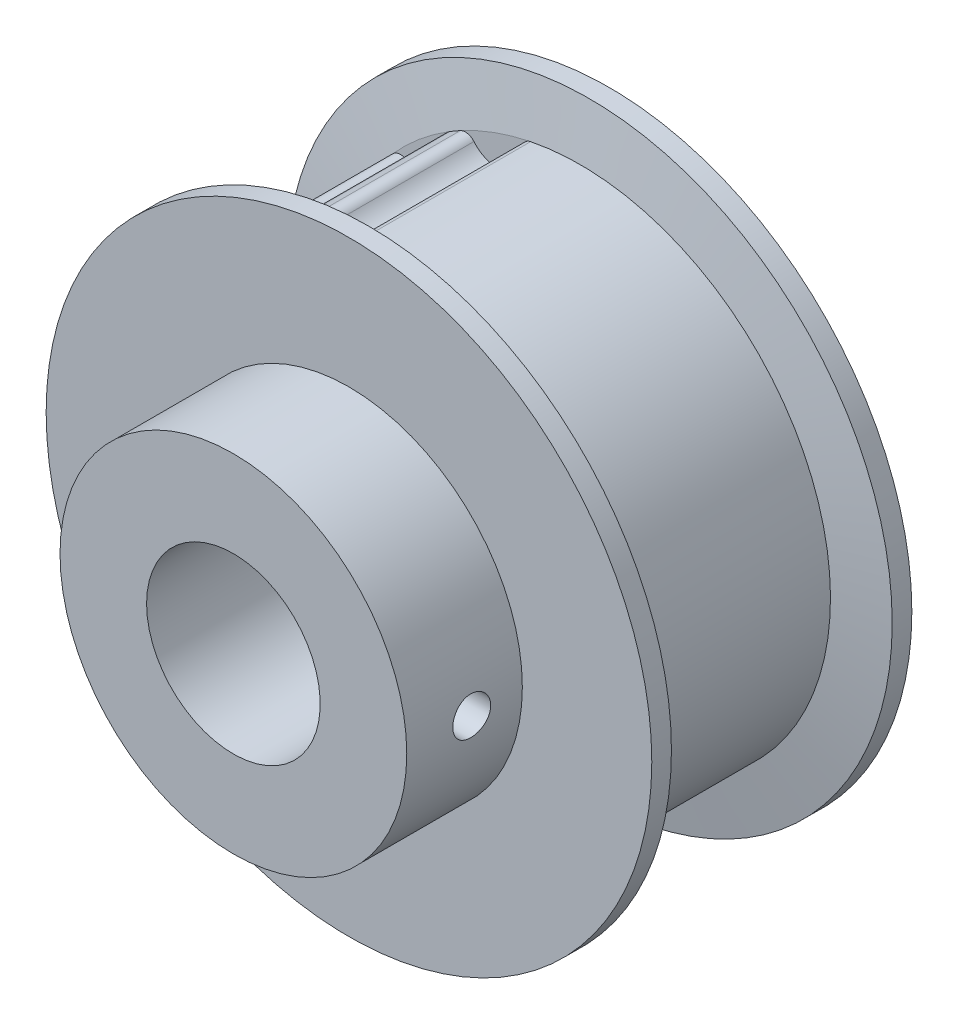
ISO-10303-21;
HEADER;
FILE_DESCRIPTION(('STEP AP214'),'2;1');
FILE_NAME('part.step','',(''),(''),'','','');
FILE_SCHEMA(('AUTOMOTIVE_DESIGN { 1 0 10303 214 1 1 1 1 }'));
ENDSEC;
DATA;
#1=APPLICATION_CONTEXT('core data for automotive mechanical design processes');
#2=APPLICATION_PROTOCOL_DEFINITION('international standard','automotive_design',2000,#1);
#3=PRODUCT_CONTEXT('',#1,'mechanical');
#4=PRODUCT('Part','Part','',(#3));
#5=PRODUCT_RELATED_PRODUCT_CATEGORY('part','',(#4));
#6=PRODUCT_DEFINITION_FORMATION('','',#4);
#7=PRODUCT_DEFINITION_CONTEXT('part definition',#1,'design');
#8=PRODUCT_DEFINITION('design','',#6,#7);
#9=PRODUCT_DEFINITION_SHAPE('','',#8);
#10=(LENGTH_UNIT() NAMED_UNIT(*) SI_UNIT(.MILLI.,.METRE.));
#11=(NAMED_UNIT(*) PLANE_ANGLE_UNIT() SI_UNIT($,.RADIAN.));
#12=(NAMED_UNIT(*) SI_UNIT($,.STERADIAN.) SOLID_ANGLE_UNIT());
#13=UNCERTAINTY_MEASURE_WITH_UNIT(LENGTH_MEASURE(1.E-05),#10,'distance_accuracy_value','');
#14=(GEOMETRIC_REPRESENTATION_CONTEXT(3) GLOBAL_UNCERTAINTY_ASSIGNED_CONTEXT((#13)) GLOBAL_UNIT_ASSIGNED_CONTEXT((#10,
#11,#12)) REPRESENTATION_CONTEXT('',''));
#15=CARTESIAN_POINT('',(0.,0.,0.));
#16=DIRECTION('',(0.,0.,1.));
#17=DIRECTION('',(1.,0.,0.));
#18=AXIS2_PLACEMENT_3D('',#15,#16,#17);
#19=CARTESIAN_POINT('',(0.,0.,13.49375));
#20=DIRECTION('',(0.,0.,1.));
#21=DIRECTION('',(1.,0.,0.));
#22=AXIS2_PLACEMENT_3D('',#19,#20,#21);
#23=PLANE('',#22);
#24=CARTESIAN_POINT('',(0.,0.,13.49375));
#25=DIRECTION('',(0.,0.,-1.));
#26=DIRECTION('',(-1.,0.,0.));
#27=AXIS2_PLACEMENT_3D('',#24,#25,#26);
#28=CIRCLE('',#27,4.76885);
#29=CARTESIAN_POINT('',(-4.76885,0.,13.49375));
#30=VERTEX_POINT('',#29);
#31=EDGE_CURVE('E430',#30,#30,#28,.T.);
#32=ORIENTED_EDGE('',*,*,#31,.T.);
#33=EDGE_LOOP('',(#32));
#34=FACE_BOUND('',#33,.T.);
#35=CARTESIAN_POINT('',(0.,0.,13.49375));
#36=DIRECTION('',(0.,0.,1.));
#37=DIRECTION('',(1.,0.,0.));
#38=AXIS2_PLACEMENT_3D('',#35,#36,#37);
#39=CIRCLE('',#38,9.525);
#40=CARTESIAN_POINT('',(9.525,0.,13.49375));
#41=VERTEX_POINT('',#40);
#42=EDGE_CURVE('E257',#41,#41,#39,.F.);
#43=ORIENTED_EDGE('',*,*,#42,.F.);
#44=EDGE_LOOP('',(#43));
#45=FACE_BOUND('',#44,.T.);
#46=ADVANCED_FACE('F16',(#34,#45),#23,.T.);
#47=CARTESIAN_POINT('',(0.,0.,9.921875));
#48=DIRECTION('',(-1.,0.,0.));
#49=DIRECTION('',(0.,0.,1.));
#50=AXIS2_PLACEMENT_3D('',#47,#48,#49);
#51=CYLINDRICAL_SURFACE('',#50,1.0414);
#52=CARTESIAN_POINT('',(4.76885,0.,8.880475));
#53=CARTESIAN_POINT('',(4.76884852330847,-0.0576985977662349,8.88047783334648));
#54=CARTESIAN_POINT('',(4.76779113617703,-0.115467533123418,8.88529102624313));
#55=CARTESIAN_POINT('',(4.7636714430234,-0.229412794410988,8.90441091337079));
#56=CARTESIAN_POINT('',(4.76060523450025,-0.285585797876013,8.91873608708849));
#57=CARTESIAN_POINT('',(4.7528096560498,-0.394604188509253,8.95641099825753));
#58=CARTESIAN_POINT('',(4.74808281450999,-0.447454491220938,8.97974702161308));
#59=CARTESIAN_POINT('',(4.73747744549021,-0.548471129240607,9.03474411265659));
#60=CARTESIAN_POINT('',(4.73159927002114,-0.596638889479045,9.06640263681796));
#61=CARTESIAN_POINT('',(4.71922840595486,-0.687720111083311,9.13768932718942));
#62=CARTESIAN_POINT('',(4.71272806419331,-0.730547577913806,9.17742605747561));
#63=CARTESIAN_POINT('',(4.69989922363985,-0.808987687584566,9.26350998249827));
#64=CARTESIAN_POINT('',(4.69357074951007,-0.844599299674293,9.30985812003383));
#65=CARTESIAN_POINT('',(4.68172784625236,-0.907969596174088,9.40847706791252));
#66=CARTESIAN_POINT('',(4.6762231292802,-0.935637662620655,9.46080737794415));
#67=CARTESIAN_POINT('',(4.66675985238805,-0.9817538722819,9.56951435714228));
#68=CARTESIAN_POINT('',(4.66280109547798,-1.00020319025624,9.62589050969306));
#69=CARTESIAN_POINT('',(4.6569552161561,-1.02707665450748,9.74016386018618));
#70=CARTESIAN_POINT('',(4.65503691801135,-1.03565183848001,9.79802390989361));
#71=CARTESIAN_POINT('',(4.65339551770343,-1.04300323002775,9.91439084590502));
#72=CARTESIAN_POINT('',(4.6536721497645,-1.04178062397998,9.97289765303889));
#73=CARTESIAN_POINT('',(4.65636112309822,-1.02969272438743,10.0877742118658));
#74=CARTESIAN_POINT('',(4.65873459304935,-1.01900292544007,10.1441634777581));
#75=CARTESIAN_POINT('',(4.66528838620344,-0.988561962019837,10.2543288612698));
#76=CARTESIAN_POINT('',(4.66946882358612,-0.968810224931051,10.3081048135186));
#77=CARTESIAN_POINT('',(4.67920400334399,-0.920644101942968,10.4120117764203));
#78=CARTESIAN_POINT('',(4.68476943248521,-0.892161935123675,10.4621103240891));
#79=CARTESIAN_POINT('',(4.69664043972502,-0.827393269707686,10.556878263446));
#80=CARTESIAN_POINT('',(4.70294606567334,-0.791106266443958,10.6015473037654));
#81=CARTESIAN_POINT('',(4.71575299818434,-0.710835752314663,10.6851952486317));
#82=CARTESIAN_POINT('',(4.722255606314,-0.666704297415194,10.7240321048294));
#83=CARTESIAN_POINT('',(4.73460399425114,-0.572459848968609,10.793793179643));
#84=CARTESIAN_POINT('',(4.74044948754397,-0.522344265715604,10.8247139541441));
#85=CARTESIAN_POINT('',(4.75084460104688,-0.417367303882323,10.8777985495764));
#86=CARTESIAN_POINT('',(4.75539042446044,-0.36249261880154,10.8999367851618));
#87=CARTESIAN_POINT('',(4.762638802077,-0.249749978800202,10.934595695224));
#88=CARTESIAN_POINT('',(4.76534521412753,-0.191888564166974,10.9471365056514));
#89=CARTESIAN_POINT('',(4.76760264695253,-0.111311683540151,10.9575503142808));
#90=CARTESIAN_POINT('',(4.76806932141351,-0.0891092303293494,10.959695152105));
#91=CARTESIAN_POINT('',(4.76869328368904,-0.0446080233390702,10.9625580439646));
#92=CARTESIAN_POINT('',(4.76885057096551,-0.0223092693921756,10.9632760955186));
#93=CARTESIAN_POINT('',(4.76884852330847,0.0576985977662349,10.9632721666535));
#94=CARTESIAN_POINT('',(4.76779113617703,0.115467533123418,10.9584589737569));
#95=CARTESIAN_POINT('',(4.7636714430234,0.229412794410988,10.9393390866292));
#96=CARTESIAN_POINT('',(4.76060523450025,0.285585797876013,10.9250139129115));
#97=CARTESIAN_POINT('',(4.7528096560498,0.394604188509254,10.8873390017425));
#98=CARTESIAN_POINT('',(4.74808281450998,0.44745449122094,10.8640029783869));
#99=CARTESIAN_POINT('',(4.73747744549021,0.548471129240609,10.8090058873434));
#100=CARTESIAN_POINT('',(4.73159927002114,0.596638889479046,10.777347363182));
#101=CARTESIAN_POINT('',(4.71922840595486,0.687720111083311,10.7060606728106));
#102=CARTESIAN_POINT('',(4.71272806419331,0.730547577913807,10.6663239425244));
#103=CARTESIAN_POINT('',(4.69989922363985,0.808987687584567,10.5802400175017));
#104=CARTESIAN_POINT('',(4.69357074951007,0.844599299674294,10.5338918799662));
#105=CARTESIAN_POINT('',(4.68172784625236,0.907969596174089,10.4352729320875));
#106=CARTESIAN_POINT('',(4.67622312928019,0.935637662620656,10.3829426220558));
#107=CARTESIAN_POINT('',(4.66675985238805,0.981753872281901,10.2742356428577));
#108=CARTESIAN_POINT('',(4.66280109547798,1.00020319025624,10.2178594903069));
#109=CARTESIAN_POINT('',(4.6569552161561,1.02707665450748,10.1035861398138));
#110=CARTESIAN_POINT('',(4.65503691801135,1.03565183848001,10.0457260901064));
#111=CARTESIAN_POINT('',(4.65339551770343,1.04300323002775,9.92935915409498));
#112=CARTESIAN_POINT('',(4.6536721497645,1.04178062397998,9.87085234696111));
#113=CARTESIAN_POINT('',(4.65636112309822,1.02969272438743,9.75597578813423));
#114=CARTESIAN_POINT('',(4.65873459304935,1.01900292544007,9.69958652224186));
#115=CARTESIAN_POINT('',(4.66528838620344,0.988561962019837,9.5894211387302));
#116=CARTESIAN_POINT('',(4.66946882358612,0.968810224931051,9.53564518648141));
#117=CARTESIAN_POINT('',(4.67920400334399,0.920644101942968,9.43173822357966));
#118=CARTESIAN_POINT('',(4.68476943248521,0.892161935123675,9.38163967591089));
#119=CARTESIAN_POINT('',(4.69664043972502,0.827393269707686,9.28687173655398));
#120=CARTESIAN_POINT('',(4.70294606567334,0.791106266443958,9.24220269623464));
#121=CARTESIAN_POINT('',(4.71575299818434,0.710835752314663,9.15855475136825));
#122=CARTESIAN_POINT('',(4.722255606314,0.666704297415194,9.11971789517061));
#123=CARTESIAN_POINT('',(4.73460399425114,0.572459848968609,9.04995682035704));
#124=CARTESIAN_POINT('',(4.74044948754397,0.522344265715604,9.01903604585591));
#125=CARTESIAN_POINT('',(4.75084460104688,0.417367303882323,8.96595145042363));
#126=CARTESIAN_POINT('',(4.75539042446044,0.36249261880154,8.94381321483817));
#127=CARTESIAN_POINT('',(4.762638802077,0.249749978800202,8.90915430477605));
#128=CARTESIAN_POINT('',(4.76534521412753,0.191888564166974,8.89661349434864));
#129=CARTESIAN_POINT('',(4.76760264695253,0.111311683540151,8.88619968571916));
#130=CARTESIAN_POINT('',(4.76806932141351,0.0891092303293492,8.88405484789503));
#131=CARTESIAN_POINT('',(4.76869328368904,0.0446080233390703,8.8811919560354));
#132=CARTESIAN_POINT('',(4.76885057096551,0.0223092693921757,8.88047390448135));
#133=CARTESIAN_POINT('',(4.76885,0.,8.880475));
#134=B_SPLINE_CURVE_WITH_KNOTS('',3,(#52,#53,#54,#55,#56,#57,#58,#59,#60,#61,#62,#63,#64,#65,
#66,#67,#68,#69,#70,#71,#72,#73,#74,#75,#76,#77,#78,#79,#80,#81,#82,#83,#84,#85,#86,#87,#88,#89,
#90,#91,#92,#93,#94,#95,#96,#97,#98,#99,#100,#101,#102,#103,#104,#105,#106,#107,#108,#109,#110,
#111,#112,#113,#114,#115,#116,#117,#118,#119,#120,#121,#122,#123,#124,#125,#126,#127,#128,#129,
#130,#131,#132,#133),.UNSPECIFIED.,.T.,.F.,(4,2,2,2,2,2,2,2,2,2,2,2,2,2,2,2,2,2,2,2,2,2,2,2,2,2,
2,2,2,2,2,2,2,2,2,2,2,2,2,2,4),(0.,0.173010416635859,0.346357938104146,0.519442665986896,
0.692474557008029,0.868007080836766,1.04356466100289,1.22105188557719,1.39851648690266,
1.57322888537201,1.74792012890324,1.91943933661092,2.09096938395979,2.2638664077814,
2.43677461462704,2.61337902633212,2.79006014468995,2.967252256972,3.14407158301989,
3.2109662638097,3.27786106094185,3.45087147757771,3.624218999046,3.79730372692875,
3.97033561794988,4.14586814177862,4.32142572194474,4.49891294651904,4.67637754784452,
4.85108994631387,5.0257811898451,5.19730039755278,5.36883044490165,5.54172746872326,
5.71463567556889,5.89124008727397,6.06792120563181,6.24511331791386,6.42193264396174,
6.48882732475156,6.55572212188371),.UNSPECIFIED.);
#135=CARTESIAN_POINT('',(4.76885,0.,8.880475));
#136=VERTEX_POINT('',#135);
#137=EDGE_CURVE('E19',#136,#136,#134,.T.);
#138=ORIENTED_EDGE('',*,*,#137,.T.);
#139=EDGE_LOOP('',(#138));
#140=FACE_BOUND('',#139,.T.);
#141=CARTESIAN_POINT('',(9.525,0.,10.963275));
#142=CARTESIAN_POINT('',(9.52499884639291,0.0582735292877629,10.9632703283392));
#143=CARTESIAN_POINT('',(9.52445933936864,0.116595322619603,10.9583657462391));
#144=CARTESIAN_POINT('',(9.52235688032514,0.231674615958853,10.9388603132041));
#145=CARTESIAN_POINT('',(9.52079178568485,0.288428581251985,10.9242391618529));
#146=CARTESIAN_POINT('',(9.51681512818299,0.398610716462479,10.8857338292278));
#147=CARTESIAN_POINT('',(9.51440442439465,0.452042197152047,10.861859046351));
#148=CARTESIAN_POINT('',(9.50900607943094,0.554115245606015,10.8055419729624));
#149=CARTESIAN_POINT('',(9.50601868600653,0.602758856780225,10.773103359356));
#150=CARTESIAN_POINT('',(9.49978626741521,0.694113585429947,10.7004250789522));
#151=CARTESIAN_POINT('',(9.4965402846776,0.736800873572002,10.6601555379607));
#152=CARTESIAN_POINT('',(9.49016425329055,0.814827559109186,10.5730206194688));
#153=CARTESIAN_POINT('',(9.48703421590986,0.850166243823228,10.5261546029686));
#154=CARTESIAN_POINT('',(9.4812353245689,0.912573290224957,10.4270119986482));
#155=CARTESIAN_POINT('',(9.47856765765727,0.93962049790762,10.3747220196864));
#156=CARTESIAN_POINT('',(9.47400738878788,0.984541426813792,10.2663088138172));
#157=CARTESIAN_POINT('',(9.4721147573862,1.00241549653528,10.2101857326255));
#158=CARTESIAN_POINT('',(9.46932745871274,1.0284135860093,10.0959376370461));
#159=CARTESIAN_POINT('',(9.46842882035886,1.03657641291381,10.037821552076));
#160=CARTESIAN_POINT('',(9.46771900124972,1.04304030312059,9.92103776293238));
#161=CARTESIAN_POINT('',(9.46790778857706,1.04134165587035,9.86237007499956));
#162=CARTESIAN_POINT('',(9.46934785721121,1.02816278176514,9.74641761833394));
#163=CARTESIAN_POINT('',(9.47059451212957,1.01672514582905,9.68912794324888));
#164=CARTESIAN_POINT('',(9.47400264649458,0.984459128926173,9.57728563967636));
#165=CARTESIAN_POINT('',(9.47616414869426,0.96363051439681,9.52273307930106));
#166=CARTESIAN_POINT('',(9.48116381762611,0.913126360227213,9.41777858563978));
#167=CARTESIAN_POINT('',(9.48400343954042,0.883431760228055,9.36738589636309));
#168=CARTESIAN_POINT('',(9.49003790511303,0.816054943773715,9.27228736899015));
#169=CARTESIAN_POINT('',(9.49323273206631,0.778373102876901,9.22758126367003));
#170=CARTESIAN_POINT('',(9.49963783803421,0.695861448725414,9.14488072390628));
#171=CARTESIAN_POINT('',(9.50284811298077,0.650996249503975,9.10692158792468));
#172=CARTESIAN_POINT('',(9.50890863475555,0.555488462772246,9.03905031141228));
#173=CARTESIAN_POINT('',(9.51175871514799,0.504843224888206,9.00914188372794));
#174=CARTESIAN_POINT('',(9.51677936130814,0.399169316534392,8.95822404776294));
#175=CARTESIAN_POINT('',(9.51894921472695,0.344136126026761,8.93722396042425));
#176=CARTESIAN_POINT('',(9.52235521284579,0.231386038017177,8.90481923855413));
#177=CARTESIAN_POINT('',(9.52359333607432,0.173675105144426,8.89339426537073));
#178=CARTESIAN_POINT('',(9.52476564503519,0.0771251617079257,8.88261573509716));
#179=CARTESIAN_POINT('',(9.52500076361025,0.0385731544175606,8.88047190767498));
#180=CARTESIAN_POINT('',(9.52499884639291,-0.0582735292877636,8.88047967166077));
#181=CARTESIAN_POINT('',(9.52445933936864,-0.116595322619604,8.88538425376087));
#182=CARTESIAN_POINT('',(9.52235688032514,-0.231674615958854,8.90488968679589));
#183=CARTESIAN_POINT('',(9.52079178568485,-0.288428581251986,8.91951083814708));
#184=CARTESIAN_POINT('',(9.51681512818299,-0.39861071646248,8.95801617077216));
#185=CARTESIAN_POINT('',(9.51440442439465,-0.452042197152048,8.98189095364897));
#186=CARTESIAN_POINT('',(9.50900607943094,-0.554115245606016,9.03820802703758));
#187=CARTESIAN_POINT('',(9.50601868600653,-0.602758856780226,9.07064664064402));
#188=CARTESIAN_POINT('',(9.49978626741521,-0.694113585429948,9.14332492104782));
#189=CARTESIAN_POINT('',(9.4965402846776,-0.736800873572002,9.18359446203933));
#190=CARTESIAN_POINT('',(9.49016425329055,-0.814827559109186,9.27072938053116));
#191=CARTESIAN_POINT('',(9.48703421590986,-0.850166243823228,9.31759539703144));
#192=CARTESIAN_POINT('',(9.4812353245689,-0.912573290224956,9.41673800135184));
#193=CARTESIAN_POINT('',(9.47856765765727,-0.93962049790762,9.46902798031357));
#194=CARTESIAN_POINT('',(9.47400738878788,-0.984541426813792,9.57744118618277));
#195=CARTESIAN_POINT('',(9.4721147573862,-1.00241549653528,9.63356426737452));
#196=CARTESIAN_POINT('',(9.46932745871274,-1.0284135860093,9.74781236295391));
#197=CARTESIAN_POINT('',(9.46842882035886,-1.03657641291381,9.80592844792398));
#198=CARTESIAN_POINT('',(9.46771900124972,-1.04304030312059,9.92271223706762));
#199=CARTESIAN_POINT('',(9.46790778857706,-1.04134165587035,9.98137992500044));
#200=CARTESIAN_POINT('',(9.46934785721121,-1.02816278176514,10.0973323816661));
#201=CARTESIAN_POINT('',(9.47059451212957,-1.01672514582905,10.1546220567511));
#202=CARTESIAN_POINT('',(9.47400264649458,-0.984459128926173,10.2664643603236));
#203=CARTESIAN_POINT('',(9.47616414869426,-0.96363051439681,10.3210169206989));
#204=CARTESIAN_POINT('',(9.48116381762611,-0.913126360227212,10.4259714143602));
#205=CARTESIAN_POINT('',(9.48400343954042,-0.883431760228054,10.4763641036369));
#206=CARTESIAN_POINT('',(9.49003790511303,-0.816054943773715,10.5714626310099));
#207=CARTESIAN_POINT('',(9.49323273206631,-0.7783731028769,10.61616873633));
#208=CARTESIAN_POINT('',(9.49963783803421,-0.695861448725414,10.6988692760937));
#209=CARTESIAN_POINT('',(9.50284811298077,-0.650996249503975,10.7368284120753));
#210=CARTESIAN_POINT('',(9.50890863475556,-0.555488462772245,10.8046996885877));
#211=CARTESIAN_POINT('',(9.51175871514799,-0.504843224888204,10.8346081162721));
#212=CARTESIAN_POINT('',(9.51677936130814,-0.399169316534392,10.8855259522371));
#213=CARTESIAN_POINT('',(9.51894921472695,-0.344136126026761,10.9065260395757));
#214=CARTESIAN_POINT('',(9.52235521284579,-0.231386038017177,10.9389307614459));
#215=CARTESIAN_POINT('',(9.52359333607432,-0.173675105144426,10.9503557346293));
#216=CARTESIAN_POINT('',(9.52476564503519,-0.0771251617079251,10.9611342649028));
#217=CARTESIAN_POINT('',(9.52500076361025,-0.0385731544175606,10.963278092325));
#218=CARTESIAN_POINT('',(9.525,0.,10.963275));
#219=B_SPLINE_CURVE_WITH_KNOTS('',3,(#141,#142,#143,#144,#145,#146,#147,#148,#149,#150,#151,
#152,#153,#154,#155,#156,#157,#158,#159,#160,#161,#162,#163,#164,#165,#166,#167,#168,#169,#170,
#171,#172,#173,#174,#175,#176,#177,#178,#179,#180,#181,#182,#183,#184,#185,#186,#187,#188,#189,
#190,#191,#192,#193,#194,#195,#196,#197,#198,#199,#200,#201,#202,#203,#204,#205,#206,#207,#208,
#209,#210,#211,#212,#213,#214,#215,#216,#217,#218),.UNSPECIFIED.,.T.,.F.,(4,2,2,2,2,2,2,2,2,2,2,
2,2,2,2,2,2,2,2,2,2,2,2,2,2,2,2,2,2,2,2,2,2,2,2,2,2,2,4),(0.,0.174697504555782,
0.349761149509179,0.524647456045276,0.699458796416707,0.874950592016937,1.05045939920521,
1.22641232444646,1.40235856454042,1.57759931756628,1.75283492706693,1.92730810237599,
2.1017856172385,2.27664096348019,2.4514880898838,2.62722464671059,2.80304211185694,
2.97904308663591,3.15466926056693,3.27030725095389,3.44500475550967,3.62006840046307,
3.79495470699917,3.9697660473706,4.14525784297083,4.3207666501591,4.49671957540035,
4.67266581549431,4.84790656852018,5.02314217802082,5.19761535332988,5.37209286819239,
5.54694821443409,5.72179534083769,5.89753189766448,6.07334936281083,6.2493503375898,
6.42497651152082,6.54061450190778),.UNSPECIFIED.);
#220=CARTESIAN_POINT('',(9.525,0.,10.963275));
#221=VERTEX_POINT('',#220);
#222=EDGE_CURVE('E134',#221,#221,#219,.T.);
#223=ORIENTED_EDGE('',*,*,#222,.F.);
#224=EDGE_LOOP('',(#223));
#225=FACE_BOUND('',#224,.T.);
#226=ADVANCED_FACE('F258',(#140,#225),#51,.F.);
#227=CARTESIAN_POINT('',(0.,0.,-6.6710413579541));
#228=DIRECTION('',(0.,0.,1.));
#229=DIRECTION('',(1.,0.,0.));
#230=AXIS2_PLACEMENT_3D('',#227,#228,#229);
#231=CYLINDRICAL_SURFACE('',#230,13.7541);
#232=DIRECTION('',(0.,0.,1.));
#233=VECTOR('',#232,1.);
#234=CARTESIAN_POINT('',(-7.16689111322739,11.7392903780905,5.55625));
#235=LINE('',#234,#233);
#236=CARTESIAN_POINT('',(-7.16689111434911,11.7392903774061,5.55625000000001));
#237=VERTEX_POINT('',#236);
#238=CARTESIAN_POINT('',(-7.16689111434905,11.739290377406,-5.55625000000001));
#239=VERTEX_POINT('',#238);
#240=EDGE_CURVE('E152',#237,#239,#235,.F.);
#241=ORIENTED_EDGE('',*,*,#240,.F.);
#242=CARTESIAN_POINT('',(0.,0.,5.55625));
#243=DIRECTION('',(0.,0.,1.));
#244=DIRECTION('',(1.,0.,0.));
#245=AXIS2_PLACEMENT_3D('',#242,#243,#244);
#246=CIRCLE('',#245,13.7541);
#247=CARTESIAN_POINT('',(-6.58307813206106,12.0763549598864,5.55624999999971));
#248=VERTEX_POINT('',#247);
#249=EDGE_CURVE('E140',#237,#248,#246,.F.);
#250=ORIENTED_EDGE('',*,*,#249,.T.);
#251=DIRECTION('',(0.,0.,1.));
#252=VECTOR('',#251,1.);
#253=CARTESIAN_POINT('',(-6.58307813321483,12.0763549592575,5.55625));
#254=LINE('',#253,#252);
#255=CARTESIAN_POINT('',(-6.58307813206111,12.0763549598865,-5.55624999999983));
#256=VERTEX_POINT('',#255);
#257=EDGE_CURVE('E149',#256,#248,#254,.T.);
#258=ORIENTED_EDGE('',*,*,#257,.F.);
#259=CARTESIAN_POINT('',(0.,0.,-5.55625));
#260=DIRECTION('',(0.,0.,1.));
#261=DIRECTION('',(1.,0.,0.));
#262=AXIS2_PLACEMENT_3D('',#259,#260,#261);
#263=CIRCLE('',#262,13.7541);
#264=EDGE_CURVE('E155',#256,#239,#263,.T.);
#265=ORIENTED_EDGE('',*,*,#264,.T.);
#266=EDGE_LOOP('',(#241,#250,#258,#265));
#267=FACE_BOUND('',#266,.T.);
#268=ADVANCED_FACE('F148',(#267),#231,.T.);
#269=CARTESIAN_POINT('',(0.,0.,-6.6710413579541));
#270=DIRECTION('',(0.,0.,1.));
#271=DIRECTION('',(1.,0.,0.));
#272=AXIS2_PLACEMENT_3D('',#269,#270,#271);
#273=CYLINDRICAL_SURFACE('',#272,13.7541);
#274=CARTESIAN_POINT('',(0.,0.,-5.55625));
#275=DIRECTION('',(0.,0.,1.));
#276=DIRECTION('',(1.,0.,0.));
#277=AXIS2_PLACEMENT_3D('',#274,#275,#276);
#278=CIRCLE('',#277,13.7541);
#279=CARTESIAN_POINT('',(-10.3164265969862,9.09651631554607,-5.55624999999977));
#280=VERTEX_POINT('',#279);
#281=CARTESIAN_POINT('',(-10.7497484715513,8.58010341478219,-5.55624999999973));
#282=VERTEX_POINT('',#281);
#283=EDGE_CURVE('E388',#280,#282,#278,.T.);
#284=ORIENTED_EDGE('',*,*,#283,.T.);
#285=DIRECTION('',(0.,0.,1.));
#286=VECTOR('',#285,1.);
#287=CARTESIAN_POINT('',(-10.7497484707317,8.58010341580904,5.55625));
#288=LINE('',#287,#286);
#289=CARTESIAN_POINT('',(-10.7497484715514,8.58010341478228,5.5562499999997));
#290=VERTEX_POINT('',#289);
#291=EDGE_CURVE('E244',#290,#282,#288,.F.);
#292=ORIENTED_EDGE('',*,*,#291,.F.);
#293=CARTESIAN_POINT('',(0.,0.,5.55625));
#294=DIRECTION('',(0.,0.,1.));
#295=DIRECTION('',(1.,0.,0.));
#296=AXIS2_PLACEMENT_3D('',#293,#294,#295);
#297=CIRCLE('',#296,13.7541);
#298=CARTESIAN_POINT('',(-10.3164265969861,9.09651631554592,5.55624999999972));
#299=VERTEX_POINT('',#298);
#300=EDGE_CURVE('E154',#290,#299,#297,.F.);
#301=ORIENTED_EDGE('',*,*,#300,.T.);
#302=DIRECTION('',(0.,0.,1.));
#303=VECTOR('',#302,1.);
#304=CARTESIAN_POINT('',(-10.3164265978546,9.09651631456093,5.55625));
#305=LINE('',#304,#303);
#306=EDGE_CURVE('E165',#280,#299,#305,.T.);
#307=ORIENTED_EDGE('',*,*,#306,.F.);
#308=EDGE_LOOP('',(#284,#292,#301,#307));
#309=FACE_BOUND('',#308,.T.);
#310=ADVANCED_FACE('F271',(#309),#273,.T.);
#311=CARTESIAN_POINT('',(0.,0.,13.49375));
#312=DIRECTION('',(0.,0.,-1.));
#313=DIRECTION('',(-1.,0.,0.));
#314=AXIS2_PLACEMENT_3D('',#311,#312,#313);
#315=CYLINDRICAL_SURFACE('',#314,4.76885);
#316=ORIENTED_EDGE('',*,*,#31,.F.);
#317=EDGE_LOOP('',(#316));
#318=FACE_BOUND('',#317,.T.);
#319=CARTESIAN_POINT('',(0.,0.,-7.14375));
#320=DIRECTION('',(0.,0.,-1.));
#321=DIRECTION('',(-1.,0.,0.));
#322=AXIS2_PLACEMENT_3D('',#319,#320,#321);
#323=CIRCLE('',#322,4.76885);
#324=CARTESIAN_POINT('',(-4.76885,0.,-7.14375));
#325=VERTEX_POINT('',#324);
#326=EDGE_CURVE('E236',#325,#325,#323,.T.);
#327=ORIENTED_EDGE('',*,*,#326,.T.);
#328=EDGE_LOOP('',(#327));
#329=FACE_BOUND('',#328,.T.);
#330=ORIENTED_EDGE('',*,*,#137,.F.);
#331=EDGE_LOOP('',(#330));
#332=FACE_BOUND('',#331,.T.);
#333=ADVANCED_FACE('F265',(#318,#329,#332),#315,.F.);
#334=CARTESIAN_POINT('',(0.,0.,7.14375));
#335=DIRECTION('',(0.,0.,1.));
#336=DIRECTION('',(1.,0.,0.));
#337=AXIS2_PLACEMENT_3D('',#334,#335,#336);
#338=CYLINDRICAL_SURFACE('',#337,9.525);
#339=CARTESIAN_POINT('',(0.,0.,7.14375));
#340=DIRECTION('',(0.,0.,1.));
#341=DIRECTION('',(1.,0.,0.));
#342=AXIS2_PLACEMENT_3D('',#339,#340,#341);
#343=CIRCLE('',#342,9.525);
#344=CARTESIAN_POINT('',(9.525,0.,7.14375));
#345=VERTEX_POINT('',#344);
#346=EDGE_CURVE('E232',#345,#345,#343,.F.);
#347=ORIENTED_EDGE('',*,*,#346,.F.);
#348=EDGE_LOOP('',(#347));
#349=FACE_BOUND('',#348,.T.);
#350=ORIENTED_EDGE('',*,*,#42,.T.);
#351=EDGE_LOOP('',(#350));
#352=FACE_BOUND('',#351,.T.);
#353=ORIENTED_EDGE('',*,*,#222,.T.);
#354=EDGE_LOOP('',(#353));
#355=FACE_BOUND('',#354,.T.);
#356=ADVANCED_FACE('F261',(#349,#352,#355),#338,.T.);
#357=CARTESIAN_POINT('',(-6.29617020128694,11.5500355199463,5.55625));
#358=DIRECTION('',(0.,0.,1.));
#359=DIRECTION('',(1.,0.,0.));
#360=AXIS2_PLACEMENT_3D('',#357,#358,#359);
#361=CYLINDRICAL_SURFACE('',#360,0.59944);
#362=CARTESIAN_POINT('',(-6.29617020128694,11.5500355199463,-5.55625));
#363=DIRECTION('',(0.,0.,1.));
#364=DIRECTION('',(1.,0.,0.));
#365=AXIS2_PLACEMENT_3D('',#362,#363,#364);
#366=CIRCLE('',#365,0.59944);
#367=CARTESIAN_POINT('',(-5.83366240293611,11.9313685109982,-5.55625));
#368=VERTEX_POINT('',#367);
#369=EDGE_CURVE('E133',#368,#256,#366,.T.);
#370=ORIENTED_EDGE('',*,*,#369,.T.);
#371=ORIENTED_EDGE('',*,*,#257,.T.);
#372=CARTESIAN_POINT('',(-6.29617020128694,11.5500355199463,5.55625));
#373=DIRECTION('',(0.,0.,1.));
#374=DIRECTION('',(1.,0.,0.));
#375=AXIS2_PLACEMENT_3D('',#372,#373,#374);
#376=CIRCLE('',#375,0.59944);
#377=CARTESIAN_POINT('',(-5.83366240293611,11.9313685109982,5.55625));
#378=VERTEX_POINT('',#377);
#379=EDGE_CURVE('E121',#248,#378,#376,.F.);
#380=ORIENTED_EDGE('',*,*,#379,.T.);
#381=DIRECTION('',(0.,0.,1.));
#382=VECTOR('',#381,1.);
#383=CARTESIAN_POINT('',(-5.83366240293585,11.9313685109977,5.55625));
#384=LINE('',#383,#382);
#385=EDGE_CURVE('E235',#378,#368,#384,.F.);
#386=ORIENTED_EDGE('',*,*,#385,.T.);
#387=EDGE_LOOP('',(#370,#371,#380,#386));
#388=FACE_BOUND('',#387,.T.);
#389=ADVANCED_FACE('F157',(#388),#361,.T.);
#390=CARTESIAN_POINT('',(-9.86680948130982,8.70006611326198,5.55625));
#391=DIRECTION('',(0.,0.,1.));
#392=DIRECTION('',(1.,0.,0.));
#393=AXIS2_PLACEMENT_3D('',#390,#391,#392);
#394=CYLINDRICAL_SURFACE('',#393,0.59944);
#395=CARTESIAN_POINT('',(-9.86680948130982,8.70006611326198,-5.55625));
#396=DIRECTION('',(0.,0.,1.));
#397=DIRECTION('',(1.,0.,0.));
#398=AXIS2_PLACEMENT_3D('',#395,#396,#397);
#399=CIRCLE('',#398,0.59944);
#400=CARTESIAN_POINT('',(-9.56261788039865,9.21658889449593,-5.55625));
#401=VERTEX_POINT('',#400);
#402=EDGE_CURVE('E160',#401,#280,#399,.T.);
#403=ORIENTED_EDGE('',*,*,#402,.T.);
#404=ORIENTED_EDGE('',*,*,#306,.T.);
#405=CARTESIAN_POINT('',(-9.86680948130982,8.70006611326198,5.55625));
#406=DIRECTION('',(0.,0.,1.));
#407=DIRECTION('',(1.,0.,0.));
#408=AXIS2_PLACEMENT_3D('',#405,#406,#407);
#409=CIRCLE('',#408,0.59944);
#410=CARTESIAN_POINT('',(-9.56261788039865,9.21658889449593,5.55625));
#411=VERTEX_POINT('',#410);
#412=EDGE_CURVE('E158',#299,#411,#409,.F.);
#413=ORIENTED_EDGE('',*,*,#412,.T.);
#414=DIRECTION('',(0.,0.,1.));
#415=VECTOR('',#414,1.);
#416=CARTESIAN_POINT('',(-9.56261788039902,9.21658889449476,5.55625));
#417=LINE('',#416,#415);
#418=EDGE_CURVE('E381',#411,#401,#417,.F.);
#419=ORIENTED_EDGE('',*,*,#418,.T.);
#420=EDGE_LOOP('',(#403,#404,#413,#419));
#421=FACE_BOUND('',#420,.T.);
#422=ADVANCED_FACE('F370',(#421),#394,.T.);
#423=CARTESIAN_POINT('',(-6.85453907424216,11.2276611008381,5.55625));
#424=DIRECTION('',(0.,0.,1.));
#425=DIRECTION('',(1.,0.,0.));
#426=AXIS2_PLACEMENT_3D('',#423,#424,#425);
#427=CYLINDRICAL_SURFACE('',#426,0.59944);
#428=DIRECTION('',(0.,0.,1.));
#429=VECTOR('',#428,1.);
#430=CARTESIAN_POINT('',(-7.41603703096851,11.0177840935449,5.55625));
#431=LINE('',#430,#429);
#432=CARTESIAN_POINT('',(-7.41603703096915,11.0177840935445,-5.55625));
#433=VERTEX_POINT('',#432);
#434=CARTESIAN_POINT('',(-7.41603703096915,11.0177840935445,5.55625));
#435=VERTEX_POINT('',#434);
#436=EDGE_CURVE('E412',#433,#435,#431,.T.);
#437=ORIENTED_EDGE('',*,*,#436,.T.);
#438=CARTESIAN_POINT('',(-6.85453907424216,11.2276611008381,5.55625));
#439=DIRECTION('',(0.,0.,1.));
#440=DIRECTION('',(1.,0.,0.));
#441=AXIS2_PLACEMENT_3D('',#438,#439,#440);
#442=CIRCLE('',#441,0.59944);
#443=EDGE_CURVE('E245',#435,#237,#442,.F.);
#444=ORIENTED_EDGE('',*,*,#443,.T.);
#445=ORIENTED_EDGE('',*,*,#240,.T.);
#446=CARTESIAN_POINT('',(-6.85453907424216,11.2276611008381,-5.55625));
#447=DIRECTION('',(0.,0.,1.));
#448=DIRECTION('',(1.,0.,0.));
#449=AXIS2_PLACEMENT_3D('',#446,#447,#448);
#450=CIRCLE('',#449,0.59944);
#451=EDGE_CURVE('E248',#239,#433,#450,.T.);
#452=ORIENTED_EDGE('',*,*,#451,.T.);
#453=EDGE_LOOP('',(#437,#444,#445,#452));
#454=FACE_BOUND('',#453,.T.);
#455=ADVANCED_FACE('F367',(#454),#427,.T.);
#456=CARTESIAN_POINT('',(-10.2812460458742,8.20615984853902,5.55625));
#457=DIRECTION('',(0.,0.,1.));
#458=DIRECTION('',(1.,0.,0.));
#459=AXIS2_PLACEMENT_3D('',#456,#457,#458);
#460=CYLINDRICAL_SURFACE('',#459,0.59944);
#461=DIRECTION('',(0.,0.,1.));
#462=VECTOR('',#461,1.);
#463=CARTESIAN_POINT('',(-10.737099368283,7.81689636187585,5.55625));
#464=LINE('',#463,#462);
#465=CARTESIAN_POINT('',(-10.7370993682826,7.81689636187555,-5.55625));
#466=VERTEX_POINT('',#465);
#467=CARTESIAN_POINT('',(-10.7370993682826,7.81689636187555,5.55625));
#468=VERTEX_POINT('',#467);
#469=EDGE_CURVE('E231',#466,#468,#464,.T.);
#470=ORIENTED_EDGE('',*,*,#469,.T.);
#471=CARTESIAN_POINT('',(-10.2812460458742,8.20615984853902,5.55625));
#472=DIRECTION('',(0.,0.,1.));
#473=DIRECTION('',(1.,0.,0.));
#474=AXIS2_PLACEMENT_3D('',#471,#472,#473);
#475=CIRCLE('',#474,0.59944);
#476=EDGE_CURVE('E239',#468,#290,#475,.F.);
#477=ORIENTED_EDGE('',*,*,#476,.T.);
#478=ORIENTED_EDGE('',*,*,#291,.T.);
#479=CARTESIAN_POINT('',(-10.2812460458742,8.20615984853902,-5.55625));
#480=DIRECTION('',(0.,0.,1.));
#481=DIRECTION('',(1.,0.,0.));
#482=AXIS2_PLACEMENT_3D('',#479,#480,#481);
#483=CIRCLE('',#482,0.59944);
#484=EDGE_CURVE('E242',#282,#466,#483,.T.);
#485=ORIENTED_EDGE('',*,*,#484,.T.);
#486=EDGE_LOOP('',(#470,#477,#478,#485));
#487=FACE_BOUND('',#486,.T.);
#488=ADVANCED_FACE('F363',(#487),#460,.T.);
#489=CARTESIAN_POINT('',(0.,0.,-7.14375));
#490=DIRECTION('',(0.,0.,1.));
#491=DIRECTION('',(1.,0.,0.));
#492=AXIS2_PLACEMENT_3D('',#489,#490,#491);
#493=PLANE('',#492);
#494=ORIENTED_EDGE('',*,*,#326,.F.);
#495=EDGE_LOOP('',(#494));
#496=FACE_BOUND('',#495,.T.);
#497=CARTESIAN_POINT('',(0.,0.,-7.14375));
#498=DIRECTION('',(0.,0.,1.));
#499=DIRECTION('',(1.,0.,0.));
#500=AXIS2_PLACEMENT_3D('',#497,#498,#499);
#501=CIRCLE('',#500,16.637);
#502=CARTESIAN_POINT('',(16.637,0.,-7.14375));
#503=VERTEX_POINT('',#502);
#504=EDGE_CURVE('E216',#503,#503,#501,.T.);
#505=ORIENTED_EDGE('',*,*,#504,.F.);
#506=EDGE_LOOP('',(#505));
#507=FACE_BOUND('',#506,.T.);
#508=ADVANCED_FACE('F359',(#496,#507),#493,.F.);
#509=CARTESIAN_POINT('',(0.,0.,7.14375));
#510=DIRECTION('',(0.,0.,1.));
#511=DIRECTION('',(1.,0.,0.));
#512=AXIS2_PLACEMENT_3D('',#509,#510,#511);
#513=PLANE('',#512);
#514=ORIENTED_EDGE('',*,*,#346,.T.);
#515=EDGE_LOOP('',(#514));
#516=FACE_BOUND('',#515,.T.);
#517=CARTESIAN_POINT('',(0.,0.,7.14375));
#518=DIRECTION('',(0.,0.,1.));
#519=DIRECTION('',(1.,0.,0.));
#520=AXIS2_PLACEMENT_3D('',#517,#518,#519);
#521=CIRCLE('',#520,16.637);
#522=CARTESIAN_POINT('',(16.637,0.,7.14375));
#523=VERTEX_POINT('',#522);
#524=EDGE_CURVE('E204',#523,#523,#521,.F.);
#525=ORIENTED_EDGE('',*,*,#524,.F.);
#526=EDGE_LOOP('',(#525));
#527=FACE_BOUND('',#526,.T.);
#528=ADVANCED_FACE('F355',(#516,#527),#513,.T.);
#529=CARTESIAN_POINT('',(-4.52257038134102,13.0123505915663,5.55625));
#530=DIRECTION('',(0.,0.,1.));
#531=DIRECTION('',(1.,0.,0.));
#532=AXIS2_PLACEMENT_3D('',#529,#530,#531);
#533=CYLINDRICAL_SURFACE('',#532,1.69926);
#534=CARTESIAN_POINT('',(-4.52257038134102,13.0123505915663,-5.55625));
#535=DIRECTION('',(0.,0.,1.));
#536=DIRECTION('',(1.,0.,0.));
#537=AXIS2_PLACEMENT_3D('',#534,#535,#536);
#538=CIRCLE('',#537,1.69926);
#539=CARTESIAN_POINT('',(-4.13401431037501,11.3581109694687,-5.55625));
#540=VERTEX_POINT('',#539);
#541=EDGE_CURVE('E222',#368,#540,#538,.T.);
#542=ORIENTED_EDGE('',*,*,#541,.F.);
#543=ORIENTED_EDGE('',*,*,#385,.F.);
#544=CARTESIAN_POINT('',(-4.52257038134102,13.0123505915663,5.55625));
#545=DIRECTION('',(0.,0.,1.));
#546=DIRECTION('',(1.,0.,0.));
#547=AXIS2_PLACEMENT_3D('',#544,#545,#546);
#548=CIRCLE('',#547,1.69926);
#549=CARTESIAN_POINT('',(-4.13401431037501,11.3581109694687,5.55625));
#550=VERTEX_POINT('',#549);
#551=EDGE_CURVE('E128',#378,#550,#548,.T.);
#552=ORIENTED_EDGE('',*,*,#551,.T.);
#553=DIRECTION('',(0.,0.,1.));
#554=VECTOR('',#553,1.);
#555=CARTESIAN_POINT('',(-4.1340143103773,11.3581109694676,5.55625));
#556=LINE('',#555,#554);
#557=EDGE_CURVE('E210',#550,#540,#556,.F.);
#558=ORIENTED_EDGE('',*,*,#557,.T.);
#559=EDGE_LOOP('',(#542,#543,#552,#558));
#560=FACE_BOUND('',#559,.T.);
#561=ADVANCED_FACE('F351',(#560),#533,.F.);
#562=CARTESIAN_POINT('',(-8.70031202866296,10.6807996599455,5.55625));
#563=DIRECTION('',(0.,0.,1.));
#564=DIRECTION('',(1.,0.,0.));
#565=AXIS2_PLACEMENT_3D('',#562,#563,#564);
#566=CYLINDRICAL_SURFACE('',#565,1.69926);
#567=CARTESIAN_POINT('',(-8.70031202866296,10.6807996599455,-5.55625));
#568=DIRECTION('',(0.,0.,1.));
#569=DIRECTION('',(1.,0.,0.));
#570=AXIS2_PLACEMENT_3D('',#567,#568,#569);
#571=CIRCLE('',#570,1.69926);
#572=CARTESIAN_POINT('',(-7.76940548337149,9.25921689712992,-5.55625));
#573=VERTEX_POINT('',#572);
#574=EDGE_CURVE('E228',#401,#573,#571,.T.);
#575=ORIENTED_EDGE('',*,*,#574,.F.);
#576=ORIENTED_EDGE('',*,*,#418,.F.);
#577=CARTESIAN_POINT('',(-8.70031202866296,10.6807996599455,5.55625));
#578=DIRECTION('',(0.,0.,1.));
#579=DIRECTION('',(1.,0.,0.));
#580=AXIS2_PLACEMENT_3D('',#577,#578,#579);
#581=CIRCLE('',#580,1.69926);
#582=CARTESIAN_POINT('',(-7.76940548337149,9.25921689712992,5.55625));
#583=VERTEX_POINT('',#582);
#584=EDGE_CURVE('E199',#411,#583,#581,.T.);
#585=ORIENTED_EDGE('',*,*,#584,.T.);
#586=DIRECTION('',(0.,0.,1.));
#587=VECTOR('',#586,1.);
#588=CARTESIAN_POINT('',(-7.76940548337214,9.25921689712923,5.55625));
#589=LINE('',#588,#587);
#590=EDGE_CURVE('E415',#583,#573,#589,.F.);
#591=ORIENTED_EDGE('',*,*,#590,.T.);
#592=EDGE_LOOP('',(#575,#576,#585,#591));
#593=FACE_BOUND('',#592,.T.);
#594=ADVANCED_FACE('F347',(#593),#566,.F.);
#595=CARTESIAN_POINT('',(-9.00774098457344,10.4228361364273,5.55625));
#596=DIRECTION('',(0.,0.,1.));
#597=DIRECTION('',(1.,0.,0.));
#598=AXIS2_PLACEMENT_3D('',#595,#596,#597);
#599=CYLINDRICAL_SURFACE('',#598,1.69926);
#600=CARTESIAN_POINT('',(-9.00774098457344,10.4228361364273,-5.55625));
#601=DIRECTION('',(0.,0.,1.));
#602=DIRECTION('',(1.,0.,0.));
#603=AXIS2_PLACEMENT_3D('',#600,#601,#602);
#604=CIRCLE('',#603,1.69926);
#605=EDGE_CURVE('E225',#573,#433,#604,.T.);
#606=ORIENTED_EDGE('',*,*,#605,.F.);
#607=ORIENTED_EDGE('',*,*,#590,.F.);
#608=CARTESIAN_POINT('',(-9.00774098457344,10.4228361364273,5.55625));
#609=DIRECTION('',(0.,0.,1.));
#610=DIRECTION('',(1.,0.,0.));
#611=AXIS2_PLACEMENT_3D('',#608,#609,#610);
#612=CIRCLE('',#611,1.69926);
#613=EDGE_CURVE('E196',#583,#435,#612,.T.);
#614=ORIENTED_EDGE('',*,*,#613,.T.);
#615=ORIENTED_EDGE('',*,*,#436,.F.);
#616=EDGE_LOOP('',(#606,#607,#614,#615));
#617=FACE_BOUND('',#616,.T.);
#618=ADVANCED_FACE('F343',(#617),#599,.F.);
#619=CARTESIAN_POINT('',(-12.0293276423964,6.71343334247654,5.55625));
#620=DIRECTION('',(0.,0.,1.));
#621=DIRECTION('',(1.,0.,0.));
#622=AXIS2_PLACEMENT_3D('',#619,#620,#621);
#623=CYLINDRICAL_SURFACE('',#622,1.69926);
#624=CARTESIAN_POINT('',(-12.0293276423964,6.71343334247654,-5.55625));
#625=DIRECTION('',(0.,0.,1.));
#626=DIRECTION('',(1.,0.,0.));
#627=AXIS2_PLACEMENT_3D('',#624,#625,#626);
#628=CIRCLE('',#627,1.69926);
#629=CARTESIAN_POINT('',(-10.4676916908583,6.04352461551167,-5.55625));
#630=VERTEX_POINT('',#629);
#631=EDGE_CURVE('E211',#630,#466,#628,.T.);
#632=ORIENTED_EDGE('',*,*,#631,.F.);
#633=DIRECTION('',(0.,0.,1.));
#634=VECTOR('',#633,1.);
#635=CARTESIAN_POINT('',(-10.4676916908581,6.04352461551187,5.55625));
#636=LINE('',#635,#634);
#637=CARTESIAN_POINT('',(-10.4676916908583,6.04352461551167,5.55625));
#638=VERTEX_POINT('',#637);
#639=EDGE_CURVE('E184',#630,#638,#636,.T.);
#640=ORIENTED_EDGE('',*,*,#639,.T.);
#641=CARTESIAN_POINT('',(-12.0293276423964,6.71343334247654,5.55625));
#642=DIRECTION('',(0.,0.,1.));
#643=DIRECTION('',(1.,0.,0.));
#644=AXIS2_PLACEMENT_3D('',#641,#642,#643);
#645=CIRCLE('',#644,1.69926);
#646=EDGE_CURVE('E191',#638,#468,#645,.T.);
#647=ORIENTED_EDGE('',*,*,#646,.T.);
#648=ORIENTED_EDGE('',*,*,#469,.F.);
#649=EDGE_LOOP('',(#632,#640,#647,#648));
#650=FACE_BOUND('',#649,.T.);
#651=ADVANCED_FACE('F339',(#650),#623,.F.);
#652=CARTESIAN_POINT('',(0.,0.,-5.55625));
#653=DIRECTION('',(0.,0.,1.));
#654=DIRECTION('',(1.,0.,0.));
#655=AXIS2_PLACEMENT_3D('',#652,#653,#654);
#656=PLANE('',#655);
#657=ORIENTED_EDGE('',*,*,#451,.F.);
#658=CARTESIAN_POINT('',(0.,0.,-5.55624999999951));
#659=DIRECTION('',(0.,0.,-1.));
#660=DIRECTION('',(-1.,0.,0.));
#661=AXIS2_PLACEMENT_3D('',#658,#659,#660);
#662=CIRCLE('',#661,13.7541000000002);
#663=EDGE_CURVE('E181',#280,#239,#662,.T.);
#664=ORIENTED_EDGE('',*,*,#663,.F.);
#665=ORIENTED_EDGE('',*,*,#402,.F.);
#666=ORIENTED_EDGE('',*,*,#574,.T.);
#667=ORIENTED_EDGE('',*,*,#605,.T.);
#668=EDGE_LOOP('',(#657,#664,#665,#666,#667));
#669=FACE_BOUND('',#668,.T.);
#670=ADVANCED_FACE('F335',(#669),#656,.T.);
#671=CARTESIAN_POINT('',(0.,0.,-5.55625));
#672=DIRECTION('',(0.,0.,1.));
#673=DIRECTION('',(1.,0.,0.));
#674=AXIS2_PLACEMENT_3D('',#671,#672,#673);
#675=PLANE('',#674);
#676=CARTESIAN_POINT('',(-2.60107352803304,12.8949407217459,-5.55625));
#677=DIRECTION('',(0.,0.,1.));
#678=DIRECTION('',(1.,0.,0.));
#679=AXIS2_PLACEMENT_3D('',#676,#677,#678);
#680=CIRCLE('',#679,0.59944);
#681=CARTESIAN_POINT('',(-3.20049117867183,12.8897644583566,-5.55625));
#682=VERTEX_POINT('',#681);
#683=CARTESIAN_POINT('',(-2.71960091670789,13.4825456670404,-5.55624999999984));
#684=VERTEX_POINT('',#683);
#685=EDGE_CURVE('E219',#682,#684,#680,.F.);
#686=ORIENTED_EDGE('',*,*,#685,.T.);
#687=CARTESIAN_POINT('',(0.,0.,-5.55624999999966));
#688=DIRECTION('',(0.,0.,-1.));
#689=DIRECTION('',(-1.,0.,0.));
#690=AXIS2_PLACEMENT_3D('',#687,#688,#689);
#691=CIRCLE('',#690,13.7541000000011);
#692=EDGE_CURVE('E178',#256,#684,#691,.T.);
#693=ORIENTED_EDGE('',*,*,#692,.F.);
#694=ORIENTED_EDGE('',*,*,#369,.F.);
#695=ORIENTED_EDGE('',*,*,#541,.T.);
#696=CARTESIAN_POINT('',(-4.89968782391438,12.8750910676455,-5.55625));
#697=DIRECTION('',(0.,0.,1.));
#698=DIRECTION('',(1.,0.,0.));
#699=AXIS2_PLACEMENT_3D('',#696,#697,#698);
#700=CIRCLE('',#699,1.69926);
#701=EDGE_CURVE('E207',#540,#682,#700,.T.);
#702=ORIENTED_EDGE('',*,*,#701,.T.);
#703=EDGE_LOOP('',(#686,#693,#694,#695,#702));
#704=FACE_BOUND('',#703,.T.);
#705=ADVANCED_FACE('F331',(#704),#675,.T.);
#706=CARTESIAN_POINT('',(0.,0.,-7.14375));
#707=DIRECTION('',(0.,0.,1.));
#708=DIRECTION('',(1.,0.,0.));
#709=AXIS2_PLACEMENT_3D('',#706,#707,#708);
#710=CYLINDRICAL_SURFACE('',#709,16.637);
#711=ORIENTED_EDGE('',*,*,#504,.T.);
#712=EDGE_LOOP('',(#711));
#713=FACE_BOUND('',#712,.T.);
#714=CARTESIAN_POINT('',(0.,0.,-6.06458305268467));
#715=DIRECTION('',(0.,0.,-1.));
#716=DIRECTION('',(0.,-1.,0.));
#717=AXIS2_PLACEMENT_3D('',#714,#715,#716);
#718=CIRCLE('',#717,16.6369999999999);
#719=CARTESIAN_POINT('',(0.,-16.6369999999999,-6.06458305268467));
#720=VERTEX_POINT('',#719);
#721=EDGE_CURVE('E177',#720,#720,#718,.F.);
#722=ORIENTED_EDGE('',*,*,#721,.F.);
#723=EDGE_LOOP('',(#722));
#724=FACE_BOUND('',#723,.T.);
#725=ADVANCED_FACE('F327',(#713,#724),#710,.T.);
#726=CARTESIAN_POINT('',(0.,0.,-5.55625));
#727=DIRECTION('',(0.,0.,1.));
#728=DIRECTION('',(1.,0.,0.));
#729=AXIS2_PLACEMENT_3D('',#726,#727,#728);
#730=PLANE('',#729);
#731=ORIENTED_EDGE('',*,*,#484,.F.);
#732=CARTESIAN_POINT('',(0.,0.,-5.55624999999943));
#733=DIRECTION('',(0.,0.,-1.));
#734=DIRECTION('',(-1.,0.,0.));
#735=AXIS2_PLACEMENT_3D('',#732,#733,#734);
#736=CIRCLE('',#735,13.7540999999998);
#737=CARTESIAN_POINT('',(-12.8054617600753,5.01950355326604,-5.55624999999973));
#738=VERTEX_POINT('',#737);
#739=EDGE_CURVE('E174',#738,#282,#736,.T.);
#740=ORIENTED_EDGE('',*,*,#739,.F.);
#741=CARTESIAN_POINT('',(-12.2473659192883,4.80074033401702,-5.55625));
#742=DIRECTION('',(0.,0.,1.));
#743=DIRECTION('',(1.,0.,0.));
#744=AXIS2_PLACEMENT_3D('',#741,#742,#743);
#745=CIRCLE('',#744,0.59944);
#746=CARTESIAN_POINT('',(-12.1381805122751,5.39015263495362,-5.55625));
#747=VERTEX_POINT('',#746);
#748=EDGE_CURVE('E214',#738,#747,#745,.F.);
#749=ORIENTED_EDGE('',*,*,#748,.T.);
#750=CARTESIAN_POINT('',(-11.8286676423964,7.06098665752346,-5.55625));
#751=DIRECTION('',(0.,0.,1.));
#752=DIRECTION('',(1.,0.,0.));
#753=AXIS2_PLACEMENT_3D('',#750,#751,#752);
#754=CIRCLE('',#753,1.69926);
#755=EDGE_CURVE('E185',#747,#630,#754,.T.);
#756=ORIENTED_EDGE('',*,*,#755,.T.);
#757=ORIENTED_EDGE('',*,*,#631,.T.);
#758=EDGE_LOOP('',(#731,#740,#749,#756,#757));
#759=FACE_BOUND('',#758,.T.);
#760=ADVANCED_FACE('F323',(#759),#730,.T.);
#761=CARTESIAN_POINT('',(-4.89968782391438,12.8750910676455,5.55625));
#762=DIRECTION('',(0.,0.,1.));
#763=DIRECTION('',(1.,0.,0.));
#764=AXIS2_PLACEMENT_3D('',#761,#762,#763);
#765=CYLINDRICAL_SURFACE('',#764,1.69926);
#766=ORIENTED_EDGE('',*,*,#701,.F.);
#767=ORIENTED_EDGE('',*,*,#557,.F.);
#768=CARTESIAN_POINT('',(-4.89968782391438,12.8750910676455,5.55625));
#769=DIRECTION('',(0.,0.,1.));
#770=DIRECTION('',(1.,0.,0.));
#771=AXIS2_PLACEMENT_3D('',#768,#769,#770);
#772=CIRCLE('',#771,1.69926);
#773=CARTESIAN_POINT('',(-3.20049117867161,12.8897644583566,5.55625));
#774=VERTEX_POINT('',#773);
#775=EDGE_CURVE('E201',#550,#774,#772,.T.);
#776=ORIENTED_EDGE('',*,*,#775,.T.);
#777=DIRECTION('',(0.,0.,1.));
#778=VECTOR('',#777,1.);
#779=CARTESIAN_POINT('',(-3.20049117867183,12.889764458357,5.55625));
#780=LINE('',#779,#778);
#781=EDGE_CURVE('E173',#682,#774,#780,.T.);
#782=ORIENTED_EDGE('',*,*,#781,.F.);
#783=EDGE_LOOP('',(#766,#767,#776,#782));
#784=FACE_BOUND('',#783,.T.);
#785=ADVANCED_FACE('F319',(#784),#765,.F.);
#786=CARTESIAN_POINT('',(0.,0.,-7.14375));
#787=DIRECTION('',(0.,0.,1.));
#788=DIRECTION('',(1.,0.,0.));
#789=AXIS2_PLACEMENT_3D('',#786,#787,#788);
#790=CYLINDRICAL_SURFACE('',#789,16.637);
#791=ORIENTED_EDGE('',*,*,#524,.T.);
#792=EDGE_LOOP('',(#791));
#793=FACE_BOUND('',#792,.T.);
#794=CARTESIAN_POINT('',(0.,0.,6.06458305268467));
#795=DIRECTION('',(0.,0.,1.));
#796=DIRECTION('',(0.,1.,0.));
#797=AXIS2_PLACEMENT_3D('',#794,#795,#796);
#798=CIRCLE('',#797,16.6369999999999);
#799=CARTESIAN_POINT('',(0.,16.6369999999999,6.06458305268467));
#800=VERTEX_POINT('',#799);
#801=EDGE_CURVE('E144',#800,#800,#798,.F.);
#802=ORIENTED_EDGE('',*,*,#801,.F.);
#803=EDGE_LOOP('',(#802));
#804=FACE_BOUND('',#803,.T.);
#805=ADVANCED_FACE('F316',(#793,#804),#790,.T.);
#806=CARTESIAN_POINT('',(0.,0.,5.55625));
#807=DIRECTION('',(0.,0.,1.));
#808=DIRECTION('',(1.,0.,0.));
#809=AXIS2_PLACEMENT_3D('',#806,#807,#808);
#810=PLANE('',#809);
#811=ORIENTED_EDGE('',*,*,#775,.F.);
#812=ORIENTED_EDGE('',*,*,#551,.F.);
#813=ORIENTED_EDGE('',*,*,#379,.F.);
#814=CARTESIAN_POINT('',(0.,0.,5.5562499999994));
#815=DIRECTION('',(0.,0.,1.));
#816=DIRECTION('',(1.,0.,0.));
#817=AXIS2_PLACEMENT_3D('',#814,#815,#816);
#818=CIRCLE('',#817,13.7540999999996);
#819=CARTESIAN_POINT('',(-2.71960091670789,13.4825456670404,5.5562499999997));
#820=VERTEX_POINT('',#819);
#821=EDGE_CURVE('E126',#820,#248,#818,.T.);
#822=ORIENTED_EDGE('',*,*,#821,.F.);
#823=CARTESIAN_POINT('',(-2.60107352803304,12.8949407217459,5.55625));
#824=DIRECTION('',(0.,0.,1.));
#825=DIRECTION('',(1.,0.,0.));
#826=AXIS2_PLACEMENT_3D('',#823,#824,#825);
#827=CIRCLE('',#826,0.59944);
#828=EDGE_CURVE('E171',#774,#820,#827,.F.);
#829=ORIENTED_EDGE('',*,*,#828,.F.);
#830=EDGE_LOOP('',(#811,#812,#813,#822,#829));
#831=FACE_BOUND('',#830,.T.);
#832=ADVANCED_FACE('F124',(#831),#810,.F.);
#833=CARTESIAN_POINT('',(0.,0.,5.55625));
#834=DIRECTION('',(0.,0.,1.));
#835=DIRECTION('',(1.,0.,0.));
#836=AXIS2_PLACEMENT_3D('',#833,#834,#835);
#837=PLANE('',#836);
#838=ORIENTED_EDGE('',*,*,#613,.F.);
#839=ORIENTED_EDGE('',*,*,#584,.F.);
#840=ORIENTED_EDGE('',*,*,#412,.F.);
#841=CARTESIAN_POINT('',(0.,0.,5.55624999999942));
#842=DIRECTION('',(0.,0.,1.));
#843=DIRECTION('',(1.,0.,0.));
#844=AXIS2_PLACEMENT_3D('',#841,#842,#843);
#845=CIRCLE('',#844,13.7540999999997);
#846=EDGE_CURVE('E143',#237,#299,#845,.T.);
#847=ORIENTED_EDGE('',*,*,#846,.F.);
#848=ORIENTED_EDGE('',*,*,#443,.F.);
#849=EDGE_LOOP('',(#838,#839,#840,#847,#848));
#850=FACE_BOUND('',#849,.T.);
#851=ADVANCED_FACE('F309',(#850),#837,.F.);
#852=CARTESIAN_POINT('',(0.,0.,5.55625));
#853=DIRECTION('',(0.,0.,1.));
#854=DIRECTION('',(1.,0.,0.));
#855=AXIS2_PLACEMENT_3D('',#852,#853,#854);
#856=PLANE('',#855);
#857=ORIENTED_EDGE('',*,*,#646,.F.);
#858=CARTESIAN_POINT('',(-11.8286676423964,7.06098665752346,5.55625));
#859=DIRECTION('',(0.,0.,1.));
#860=DIRECTION('',(1.,0.,0.));
#861=AXIS2_PLACEMENT_3D('',#858,#859,#860);
#862=CIRCLE('',#861,1.69926);
#863=CARTESIAN_POINT('',(-12.1381805122751,5.39015263495362,5.55625));
#864=VERTEX_POINT('',#863);
#865=EDGE_CURVE('E188',#638,#864,#862,.F.);
#866=ORIENTED_EDGE('',*,*,#865,.T.);
#867=CARTESIAN_POINT('',(-12.2473659192883,4.80074033401702,5.55625));
#868=DIRECTION('',(0.,0.,1.));
#869=DIRECTION('',(1.,0.,0.));
#870=AXIS2_PLACEMENT_3D('',#867,#868,#869);
#871=CIRCLE('',#870,0.59944);
#872=CARTESIAN_POINT('',(-12.8054617600753,5.01950355326604,5.5562499999997));
#873=VERTEX_POINT('',#872);
#874=EDGE_CURVE('E194',#873,#864,#871,.F.);
#875=ORIENTED_EDGE('',*,*,#874,.F.);
#876=CARTESIAN_POINT('',(0.,0.,5.55624999999937));
#877=DIRECTION('',(0.,0.,1.));
#878=DIRECTION('',(1.,0.,0.));
#879=AXIS2_PLACEMENT_3D('',#876,#877,#878);
#880=CIRCLE('',#879,13.7540999999994);
#881=EDGE_CURVE('E167',#290,#873,#880,.T.);
#882=ORIENTED_EDGE('',*,*,#881,.F.);
#883=ORIENTED_EDGE('',*,*,#476,.F.);
#884=EDGE_LOOP('',(#857,#866,#875,#882,#883));
#885=FACE_BOUND('',#884,.T.);
#886=ADVANCED_FACE('F305',(#885),#856,.F.);
#887=CARTESIAN_POINT('',(-11.8286676423964,7.06098665752346,5.55625));
#888=DIRECTION('',(0.,0.,1.));
#889=DIRECTION('',(1.,0.,0.));
#890=AXIS2_PLACEMENT_3D('',#887,#888,#889);
#891=CYLINDRICAL_SURFACE('',#890,1.69926);
#892=ORIENTED_EDGE('',*,*,#755,.F.);
#893=DIRECTION('',(0.,0.,1.));
#894=VECTOR('',#893,1.);
#895=CARTESIAN_POINT('',(-12.1381805122748,5.39015263495355,5.55625));
#896=LINE('',#895,#894);
#897=EDGE_CURVE('E169',#864,#747,#896,.F.);
#898=ORIENTED_EDGE('',*,*,#897,.F.);
#899=ORIENTED_EDGE('',*,*,#865,.F.);
#900=ORIENTED_EDGE('',*,*,#639,.F.);
#901=EDGE_LOOP('',(#892,#898,#899,#900));
#902=FACE_BOUND('',#901,.T.);
#903=ADVANCED_FACE('F301',(#902),#891,.F.);
#904=CARTESIAN_POINT('',(0.,0.,-6.06458305268467));
#905=DIRECTION('',(0.,0.,-1.));
#906=DIRECTION('',(-1.,0.,0.));
#907=AXIS2_PLACEMENT_3D('',#904,#905,#906);
#908=CONICAL_SURFACE('',#907,16.6369999999999,1.3962634015952);
#909=ORIENTED_EDGE('',*,*,#721,.T.);
#910=EDGE_LOOP('',(#909));
#911=FACE_BOUND('',#910,.T.);
#912=CARTESIAN_POINT('',(0.,0.,-5.55625));
#913=DIRECTION('',(0.,0.,1.));
#914=DIRECTION('',(1.,0.,0.));
#915=AXIS2_PLACEMENT_3D('',#912,#913,#914);
#916=CIRCLE('',#915,13.7541);
#917=EDGE_CURVE('E400',#738,#684,#916,.T.);
#918=ORIENTED_EDGE('',*,*,#917,.F.);
#919=ORIENTED_EDGE('',*,*,#739,.T.);
#920=ORIENTED_EDGE('',*,*,#283,.F.);
#921=ORIENTED_EDGE('',*,*,#663,.T.);
#922=ORIENTED_EDGE('',*,*,#264,.F.);
#923=ORIENTED_EDGE('',*,*,#692,.T.);
#924=EDGE_LOOP('',(#918,#919,#920,#921,#922,#923));
#925=FACE_BOUND('',#924,.T.);
#926=ADVANCED_FACE('F297',(#911,#925),#908,.T.);
#927=CARTESIAN_POINT('',(-2.60107352803304,12.8949407217459,5.55625));
#928=DIRECTION('',(0.,0.,1.));
#929=DIRECTION('',(1.,0.,0.));
#930=AXIS2_PLACEMENT_3D('',#927,#928,#929);
#931=CYLINDRICAL_SURFACE('',#930,0.59944);
#932=ORIENTED_EDGE('',*,*,#828,.T.);
#933=DIRECTION('',(0.,0.,1.));
#934=VECTOR('',#933,1.);
#935=CARTESIAN_POINT('',(-2.71960091542022,13.4825456673006,-6.6710413579541));
#936=LINE('',#935,#934);
#937=EDGE_CURVE('E399',#684,#820,#936,.T.);
#938=ORIENTED_EDGE('',*,*,#937,.F.);
#939=ORIENTED_EDGE('',*,*,#685,.F.);
#940=ORIENTED_EDGE('',*,*,#781,.T.);
#941=EDGE_LOOP('',(#932,#938,#939,#940));
#942=FACE_BOUND('',#941,.T.);
#943=ADVANCED_FACE('F293',(#942),#931,.T.);
#944=CARTESIAN_POINT('',(0.,0.,6.06458305268467));
#945=DIRECTION('',(0.,0.,1.));
#946=DIRECTION('',(1.,0.,0.));
#947=AXIS2_PLACEMENT_3D('',#944,#945,#946);
#948=CONICAL_SURFACE('',#947,16.6369999999999,1.3962634015952);
#949=ORIENTED_EDGE('',*,*,#801,.T.);
#950=EDGE_LOOP('',(#949));
#951=FACE_BOUND('',#950,.T.);
#952=ORIENTED_EDGE('',*,*,#300,.F.);
#953=ORIENTED_EDGE('',*,*,#881,.T.);
#954=CARTESIAN_POINT('',(0.,0.,5.55625));
#955=DIRECTION('',(0.,0.,1.));
#956=DIRECTION('',(1.,0.,0.));
#957=AXIS2_PLACEMENT_3D('',#954,#955,#956);
#958=CIRCLE('',#957,13.7541);
#959=EDGE_CURVE('E28',#820,#873,#958,.F.);
#960=ORIENTED_EDGE('',*,*,#959,.F.);
#961=ORIENTED_EDGE('',*,*,#821,.T.);
#962=ORIENTED_EDGE('',*,*,#249,.F.);
#963=ORIENTED_EDGE('',*,*,#846,.T.);
#964=EDGE_LOOP('',(#952,#953,#960,#961,#962,#963));
#965=FACE_BOUND('',#964,.T.);
#966=ADVANCED_FACE('F138',(#951,#965),#948,.T.);
#967=CARTESIAN_POINT('',(-12.2473659192883,4.80074033401702,5.55625));
#968=DIRECTION('',(0.,0.,1.));
#969=DIRECTION('',(1.,0.,0.));
#970=AXIS2_PLACEMENT_3D('',#967,#968,#969);
#971=CYLINDRICAL_SURFACE('',#970,0.59944);
#972=ORIENTED_EDGE('',*,*,#748,.F.);
#973=DIRECTION('',(0.,0.,1.));
#974=VECTOR('',#973,1.);
#975=CARTESIAN_POINT('',(-12.8054617605549,5.01950355204238,-6.6710413579541));
#976=LINE('',#975,#974);
#977=EDGE_CURVE('E10',#873,#738,#976,.F.);
#978=ORIENTED_EDGE('',*,*,#977,.F.);
#979=ORIENTED_EDGE('',*,*,#874,.T.);
#980=ORIENTED_EDGE('',*,*,#897,.T.);
#981=EDGE_LOOP('',(#972,#978,#979,#980));
#982=FACE_BOUND('',#981,.T.);
#983=ADVANCED_FACE('F283',(#982),#971,.T.);
#984=CARTESIAN_POINT('',(0.,0.,-6.6710413579541));
#985=DIRECTION('',(0.,0.,1.));
#986=DIRECTION('',(1.,0.,0.));
#987=AXIS2_PLACEMENT_3D('',#984,#985,#986);
#988=CYLINDRICAL_SURFACE('',#987,13.7541);
#989=ORIENTED_EDGE('',*,*,#959,.T.);
#990=ORIENTED_EDGE('',*,*,#977,.T.);
#991=ORIENTED_EDGE('',*,*,#917,.T.);
#992=ORIENTED_EDGE('',*,*,#937,.T.);
#993=EDGE_LOOP('',(#989,#990,#991,#992));
#994=FACE_BOUND('',#993,.T.);
#995=ADVANCED_FACE('F281',(#994),#988,.T.);
#996=CLOSED_SHELL('',(#46,#226,#268,#310,#333,#356,#389,#422,#455,#488,#508,#528,#561,#594,#618,
#651,#670,#705,#725,#760,#785,#805,#832,#851,#886,#903,#926,#943,#966,#983,#995));
#997=MANIFOLD_SOLID_BREP('B1',#996);
#998=ADVANCED_BREP_SHAPE_REPRESENTATION('',(#18,#997),#14);
#999=SHAPE_DEFINITION_REPRESENTATION(#9,#998);
ENDSEC;
END-ISO-10303-21;
